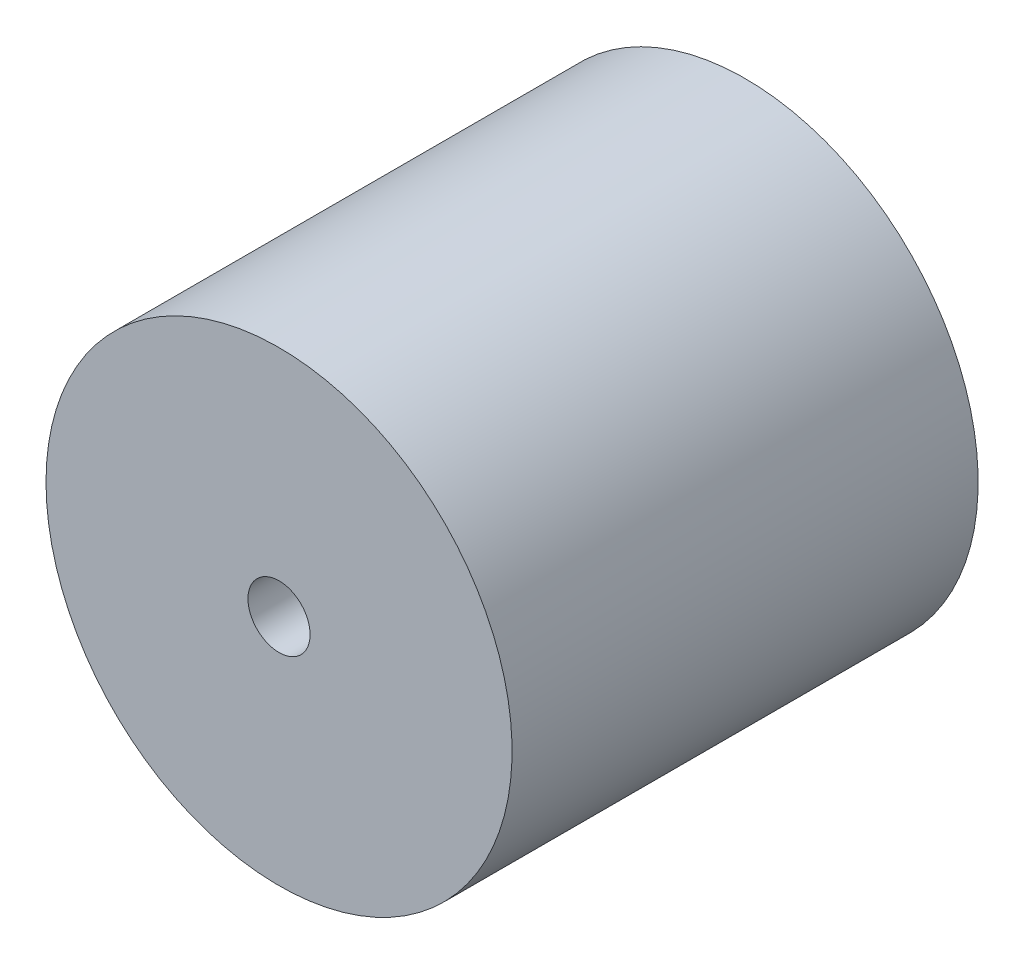
ISO-10303-21;
HEADER;
FILE_DESCRIPTION(('STEP AP214'),'2;1');
FILE_NAME('part.step','',(''),(''),'','','');
FILE_SCHEMA(('AUTOMOTIVE_DESIGN { 1 0 10303 214 1 1 1 1 }'));
ENDSEC;
DATA;
#1=APPLICATION_CONTEXT('core data for automotive mechanical design processes');
#2=APPLICATION_PROTOCOL_DEFINITION('international standard','automotive_design',2000,#1);
#3=PRODUCT_CONTEXT('',#1,'mechanical');
#4=PRODUCT('Part','Part','',(#3));
#5=PRODUCT_RELATED_PRODUCT_CATEGORY('part','',(#4));
#6=PRODUCT_DEFINITION_FORMATION('','',#4);
#7=PRODUCT_DEFINITION_CONTEXT('part definition',#1,'design');
#8=PRODUCT_DEFINITION('design','',#6,#7);
#9=PRODUCT_DEFINITION_SHAPE('','',#8);
#10=(LENGTH_UNIT() NAMED_UNIT(*) SI_UNIT(.MILLI.,.METRE.));
#11=(NAMED_UNIT(*) PLANE_ANGLE_UNIT() SI_UNIT($,.RADIAN.));
#12=(NAMED_UNIT(*) SI_UNIT($,.STERADIAN.) SOLID_ANGLE_UNIT());
#13=UNCERTAINTY_MEASURE_WITH_UNIT(LENGTH_MEASURE(1.E-05),#10,'distance_accuracy_value','');
#14=(GEOMETRIC_REPRESENTATION_CONTEXT(3) GLOBAL_UNCERTAINTY_ASSIGNED_CONTEXT((#13)) GLOBAL_UNIT_ASSIGNED_CONTEXT((#10,
#11,#12)) REPRESENTATION_CONTEXT('',''));
#15=CARTESIAN_POINT('',(0.,0.,0.));
#16=DIRECTION('',(0.,0.,1.));
#17=DIRECTION('',(1.,0.,0.));
#18=AXIS2_PLACEMENT_3D('',#15,#16,#17);
#19=CARTESIAN_POINT('',(0.,0.,15.));
#20=DIRECTION('',(0.,0.,-1.));
#21=DIRECTION('',(-1.,0.,0.));
#22=AXIS2_PLACEMENT_3D('',#19,#20,#21);
#23=CYLINDRICAL_SURFACE('',#22,7.5);
#24=CARTESIAN_POINT('',(0.,0.,15.));
#25=DIRECTION('',(0.,0.,-1.));
#26=DIRECTION('',(-1.,0.,0.));
#27=AXIS2_PLACEMENT_3D('',#24,#25,#26);
#28=CIRCLE('',#27,7.5);
#29=CARTESIAN_POINT('',(-7.5,0.,15.));
#30=VERTEX_POINT('',#29);
#31=EDGE_CURVE('E10',#30,#30,#28,.T.);
#32=ORIENTED_EDGE('',*,*,#31,.T.);
#33=EDGE_LOOP('',(#32));
#34=FACE_BOUND('',#33,.T.);
#35=CARTESIAN_POINT('',(0.,0.,0.));
#36=DIRECTION('',(0.,0.,-1.));
#37=DIRECTION('',(-1.,0.,0.));
#38=AXIS2_PLACEMENT_3D('',#35,#36,#37);
#39=CIRCLE('',#38,7.5);
#40=CARTESIAN_POINT('',(-7.5,0.,0.));
#41=VERTEX_POINT('',#40);
#42=EDGE_CURVE('E45',#41,#41,#39,.T.);
#43=ORIENTED_EDGE('',*,*,#42,.F.);
#44=EDGE_LOOP('',(#43));
#45=FACE_BOUND('',#44,.T.);
#46=ADVANCED_FACE('F31',(#34,#45),#23,.T.);
#47=CARTESIAN_POINT('',(7.5,0.,15.));
#48=DIRECTION('',(0.,0.,1.));
#49=DIRECTION('',(1.,0.,0.));
#50=AXIS2_PLACEMENT_3D('',#47,#48,#49);
#51=PLANE('',#50);
#52=CARTESIAN_POINT('',(0.,0.,15.));
#53=DIRECTION('',(0.,0.,-1.));
#54=DIRECTION('',(-1.,0.,0.));
#55=AXIS2_PLACEMENT_3D('',#52,#53,#54);
#56=CIRCLE('',#55,1.);
#57=CARTESIAN_POINT('',(-1.,0.,15.));
#58=VERTEX_POINT('',#57);
#59=EDGE_CURVE('E37',#58,#58,#56,.T.);
#60=ORIENTED_EDGE('',*,*,#59,.T.);
#61=EDGE_LOOP('',(#60));
#62=FACE_BOUND('',#61,.T.);
#63=ORIENTED_EDGE('',*,*,#31,.F.);
#64=EDGE_LOOP('',(#63));
#65=FACE_BOUND('',#64,.T.);
#66=ADVANCED_FACE('F55',(#62,#65),#51,.T.);
#67=CARTESIAN_POINT('',(0.,0.,15.));
#68=DIRECTION('',(0.,0.,-1.));
#69=DIRECTION('',(-1.,0.,0.));
#70=AXIS2_PLACEMENT_3D('',#67,#68,#69);
#71=CYLINDRICAL_SURFACE('',#70,1.);
#72=CARTESIAN_POINT('',(0.,0.,0.));
#73=DIRECTION('',(0.,0.,-1.));
#74=DIRECTION('',(-1.,0.,0.));
#75=AXIS2_PLACEMENT_3D('',#72,#73,#74);
#76=CIRCLE('',#75,1.);
#77=CARTESIAN_POINT('',(-1.,0.,0.));
#78=VERTEX_POINT('',#77);
#79=EDGE_CURVE('E41',#78,#78,#76,.T.);
#80=ORIENTED_EDGE('',*,*,#79,.T.);
#81=EDGE_LOOP('',(#80));
#82=FACE_BOUND('',#81,.T.);
#83=ORIENTED_EDGE('',*,*,#59,.F.);
#84=EDGE_LOOP('',(#83));
#85=FACE_BOUND('',#84,.T.);
#86=ADVANCED_FACE('F59',(#82,#85),#71,.F.);
#87=CARTESIAN_POINT('',(1.,0.,0.));
#88=DIRECTION('',(0.,0.,-1.));
#89=DIRECTION('',(-1.,0.,0.));
#90=AXIS2_PLACEMENT_3D('',#87,#88,#89);
#91=PLANE('',#90);
#92=ORIENTED_EDGE('',*,*,#42,.T.);
#93=EDGE_LOOP('',(#92));
#94=FACE_BOUND('',#93,.T.);
#95=ORIENTED_EDGE('',*,*,#79,.F.);
#96=EDGE_LOOP('',(#95));
#97=FACE_BOUND('',#96,.T.);
#98=ADVANCED_FACE('F51',(#94,#97),#91,.T.);
#99=CLOSED_SHELL('',(#46,#66,#86,#98));
#100=MANIFOLD_SOLID_BREP('B2',#99);
#101=ADVANCED_BREP_SHAPE_REPRESENTATION('',(#18,#100),#14);
#102=SHAPE_DEFINITION_REPRESENTATION(#9,#101);
ENDSEC;
END-ISO-10303-21;
